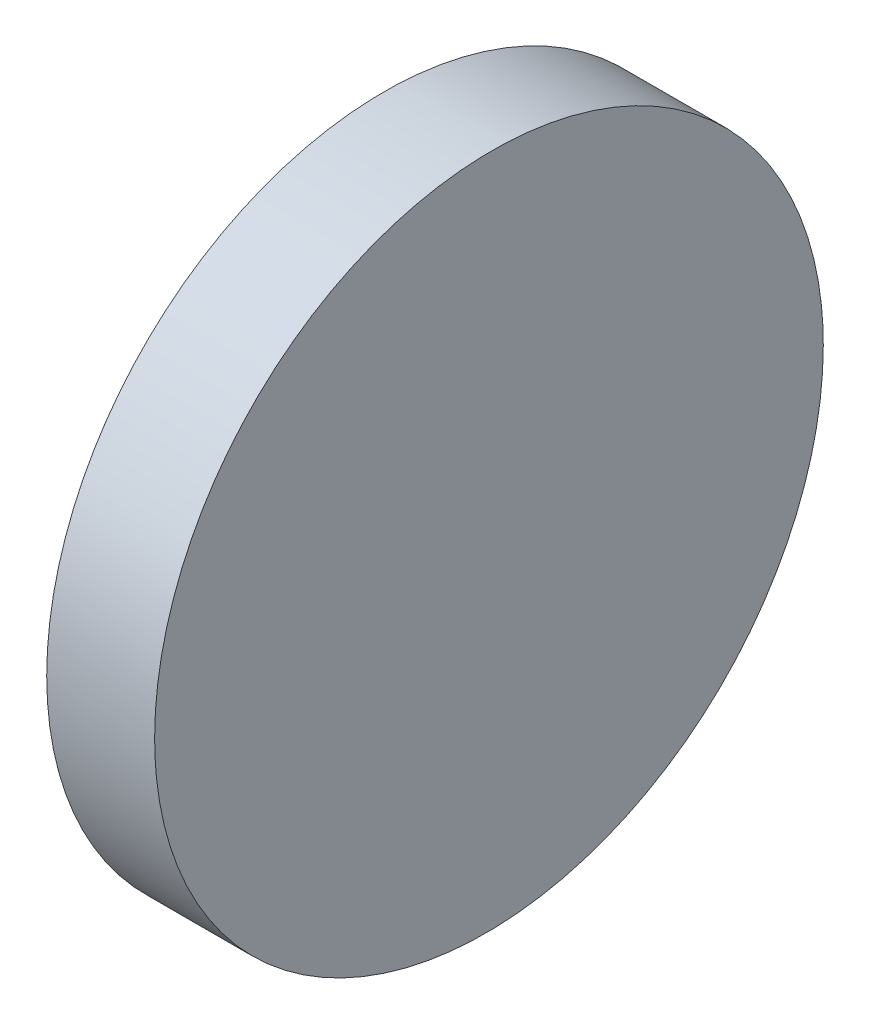
ISO-10303-21;
HEADER;
FILE_DESCRIPTION(('STEP AP214'),'2;1');
FILE_NAME('part.step','',(''),(''),'','','');
FILE_SCHEMA(('AUTOMOTIVE_DESIGN { 1 0 10303 214 1 1 1 1 }'));
ENDSEC;
DATA;
#1=APPLICATION_CONTEXT('core data for automotive mechanical design processes');
#2=APPLICATION_PROTOCOL_DEFINITION('international standard','automotive_design',2000,#1);
#3=PRODUCT_CONTEXT('',#1,'mechanical');
#4=PRODUCT('Part','Part','',(#3));
#5=PRODUCT_RELATED_PRODUCT_CATEGORY('part','',(#4));
#6=PRODUCT_DEFINITION_FORMATION('','',#4);
#7=PRODUCT_DEFINITION_CONTEXT('part definition',#1,'design');
#8=PRODUCT_DEFINITION('design','',#6,#7);
#9=PRODUCT_DEFINITION_SHAPE('','',#8);
#10=(LENGTH_UNIT() NAMED_UNIT(*) SI_UNIT(.MILLI.,.METRE.));
#11=(NAMED_UNIT(*) PLANE_ANGLE_UNIT() SI_UNIT($,.RADIAN.));
#12=(NAMED_UNIT(*) SI_UNIT($,.STERADIAN.) SOLID_ANGLE_UNIT());
#13=UNCERTAINTY_MEASURE_WITH_UNIT(LENGTH_MEASURE(1.E-05),#10,'distance_accuracy_value','');
#14=(GEOMETRIC_REPRESENTATION_CONTEXT(3) GLOBAL_UNCERTAINTY_ASSIGNED_CONTEXT((#13)) GLOBAL_UNIT_ASSIGNED_CONTEXT((#10,
#11,#12)) REPRESENTATION_CONTEXT('',''));
#15=CARTESIAN_POINT('',(0.,0.,0.));
#16=DIRECTION('',(0.,0.,1.));
#17=DIRECTION('',(1.,0.,0.));
#18=AXIS2_PLACEMENT_3D('',#15,#16,#17);
#19=CARTESIAN_POINT('',(0.,50.,-25.));
#20=DIRECTION('',(1.,0.,0.));
#21=DIRECTION('',(0.,0.,-1.));
#22=AXIS2_PLACEMENT_3D('',#19,#20,#21);
#23=PLANE('',#22);
#24=CARTESIAN_POINT('',(0.,25.,0.));
#25=DIRECTION('',(-1.,0.,0.));
#26=DIRECTION('',(0.,0.,1.));
#27=AXIS2_PLACEMENT_3D('',#24,#25,#26);
#28=CIRCLE('',#27,25.);
#29=CARTESIAN_POINT('',(0.,25.,25.));
#30=VERTEX_POINT('',#29);
#31=EDGE_CURVE('E39',#30,#30,#28,.T.);
#32=ORIENTED_EDGE('',*,*,#31,.T.);
#33=EDGE_LOOP('',(#32));
#34=FACE_BOUND('',#33,.T.);
#35=ADVANCED_FACE('F33',(#34),#23,.F.);
#36=CARTESIAN_POINT('',(8.00000000000001,50.,25.));
#37=DIRECTION('',(-0.999961923064171,0.,0.00872653549836698));
#38=DIRECTION('',(0.00872653549836698,0.,0.999961923064171));
#39=AXIS2_PLACEMENT_3D('',#36,#37,#38);
#40=PLANE('',#39);
#41=CARTESIAN_POINT('',(7.78182830523121,25.,0.));
#42=DIRECTION('',(-0.999961923064171,0.,0.00872653549836698));
#43=DIRECTION('',(-0.00872653549836698,0.,-0.999961923064171));
#44=AXIS2_PLACEMENT_3D('',#41,#42,#43);
#45=ELLIPSE('',#44,25.0009519596434,25.);
#46=CARTESIAN_POINT('',(7.56365661046241,25.,-25.));
#47=VERTEX_POINT('',#46);
#48=EDGE_CURVE('E10',#47,#47,#45,.T.);
#49=ORIENTED_EDGE('',*,*,#48,.F.);
#50=EDGE_LOOP('',(#49));
#51=FACE_BOUND('',#50,.T.);
#52=ADVANCED_FACE('F48',(#51),#40,.F.);
#53=CARTESIAN_POINT('',(12.5,25.,0.));
#54=DIRECTION('',(-1.,0.,0.));
#55=DIRECTION('',(0.,0.,1.));
#56=AXIS2_PLACEMENT_3D('',#53,#54,#55);
#57=CYLINDRICAL_SURFACE('',#56,25.);
#58=ORIENTED_EDGE('',*,*,#31,.F.);
#59=EDGE_LOOP('',(#58));
#60=FACE_BOUND('',#59,.T.);
#61=ORIENTED_EDGE('',*,*,#48,.T.);
#62=EDGE_LOOP('',(#61));
#63=FACE_BOUND('',#62,.T.);
#64=ADVANCED_FACE('F46',(#60,#63),#57,.T.);
#65=CLOSED_SHELL('',(#35,#52,#64));
#66=MANIFOLD_SOLID_BREP('B2',#65);
#67=ADVANCED_BREP_SHAPE_REPRESENTATION('',(#18,#66),#14);
#68=SHAPE_DEFINITION_REPRESENTATION(#9,#67);
ENDSEC;
END-ISO-10303-21;
